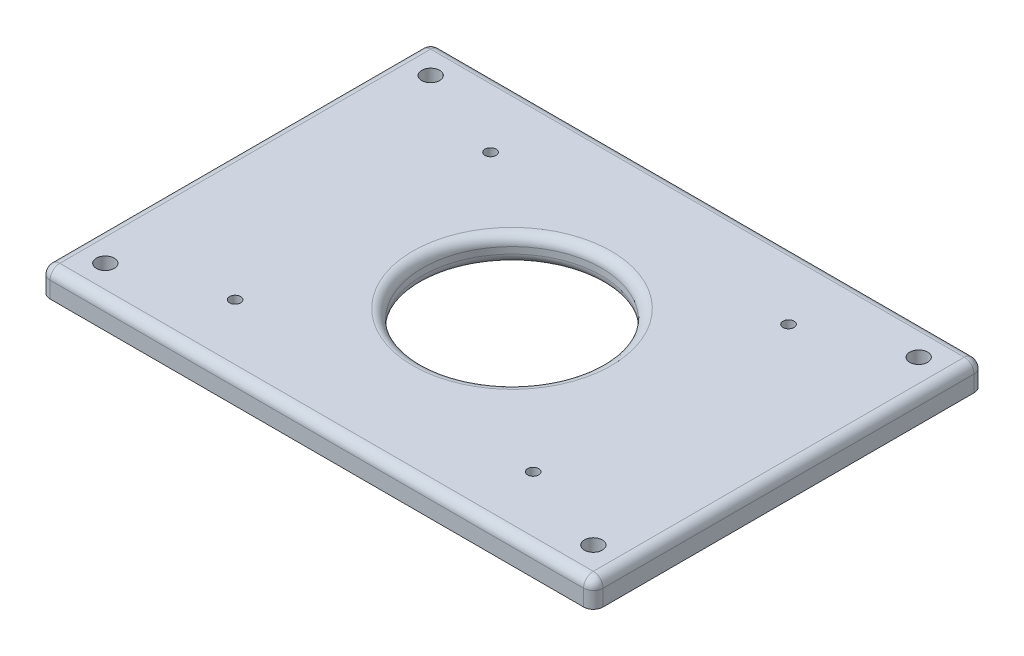
ISO-10303-21;
HEADER;
FILE_DESCRIPTION(('STEP AP214'),'2;1');
FILE_NAME('part.step','',(''),(''),'','','');
FILE_SCHEMA(('AUTOMOTIVE_DESIGN { 1 0 10303 214 1 1 1 1 }'));
ENDSEC;
DATA;
#1=APPLICATION_CONTEXT('core data for automotive mechanical design processes');
#2=APPLICATION_PROTOCOL_DEFINITION('international standard','automotive_design',2000,#1);
#3=PRODUCT_CONTEXT('',#1,'mechanical');
#4=PRODUCT('Part','Part','',(#3));
#5=PRODUCT_RELATED_PRODUCT_CATEGORY('part','',(#4));
#6=PRODUCT_DEFINITION_FORMATION('','',#4);
#7=PRODUCT_DEFINITION_CONTEXT('part definition',#1,'design');
#8=PRODUCT_DEFINITION('design','',#6,#7);
#9=PRODUCT_DEFINITION_SHAPE('','',#8);
#10=(LENGTH_UNIT() NAMED_UNIT(*) SI_UNIT(.MILLI.,.METRE.));
#11=(NAMED_UNIT(*) PLANE_ANGLE_UNIT() SI_UNIT($,.RADIAN.));
#12=(NAMED_UNIT(*) SI_UNIT($,.STERADIAN.) SOLID_ANGLE_UNIT());
#13=UNCERTAINTY_MEASURE_WITH_UNIT(LENGTH_MEASURE(1.E-05),#10,'distance_accuracy_value','');
#14=(GEOMETRIC_REPRESENTATION_CONTEXT(3) GLOBAL_UNCERTAINTY_ASSIGNED_CONTEXT((#13)) GLOBAL_UNIT_ASSIGNED_CONTEXT((#10,
#11,#12)) REPRESENTATION_CONTEXT('',''));
#15=CARTESIAN_POINT('',(0.,0.,0.));
#16=DIRECTION('',(0.,0.,1.));
#17=DIRECTION('',(1.,0.,0.));
#18=AXIS2_PLACEMENT_3D('',#15,#16,#17);
#19=CARTESIAN_POINT('',(82.,-3.,-28.));
#20=DIRECTION('',(0.,0.,-1.));
#21=DIRECTION('',(-1.,0.,0.));
#22=AXIS2_PLACEMENT_3D('',#19,#20,#21);
#23=SPHERICAL_SURFACE('',#22,3.);
#24=CARTESIAN_POINT('',(82.,-3.,-28.));
#25=DIRECTION('',(0.,-1.,0.));
#26=DIRECTION('',(0.,0.,-1.));
#27=AXIS2_PLACEMENT_3D('',#24,#25,#26);
#28=CIRCLE('',#27,3.);
#29=CARTESIAN_POINT('',(85.,-3.,-28.));
#30=VERTEX_POINT('',#29);
#31=CARTESIAN_POINT('',(82.,-3.,-25.));
#32=VERTEX_POINT('',#31);
#33=EDGE_CURVE('E11',#30,#32,#28,.T.);
#34=ORIENTED_EDGE('',*,*,#33,.F.);
#35=CARTESIAN_POINT('',(82.,-3.,-28.));
#36=DIRECTION('',(0.,0.,-1.));
#37=DIRECTION('',(-1.,0.,0.));
#38=AXIS2_PLACEMENT_3D('',#35,#36,#37);
#39=CIRCLE('',#38,3.);
#40=CARTESIAN_POINT('',(82.,0.,-28.));
#41=VERTEX_POINT('',#40);
#42=EDGE_CURVE('E147',#41,#30,#39,.T.);
#43=ORIENTED_EDGE('',*,*,#42,.F.);
#44=CARTESIAN_POINT('',(82.,-3.,-28.));
#45=DIRECTION('',(1.,0.,0.));
#46=DIRECTION('',(0.,0.,-1.));
#47=AXIS2_PLACEMENT_3D('',#44,#45,#46);
#48=CIRCLE('',#47,3.);
#49=EDGE_CURVE('E44',#41,#32,#48,.T.);
#50=ORIENTED_EDGE('',*,*,#49,.T.);
#51=EDGE_LOOP('',(#34,#43,#50));
#52=FACE_BOUND('',#51,.T.);
#53=ADVANCED_FACE('F36',(#52),#23,.T.);
#54=CARTESIAN_POINT('',(-85.,-3.,-28.));
#55=DIRECTION('',(-1.,0.,0.));
#56=DIRECTION('',(0.,0.,1.));
#57=AXIS2_PLACEMENT_3D('',#54,#55,#56);
#58=CYLINDRICAL_SURFACE('',#57,3.);
#59=ORIENTED_EDGE('',*,*,#49,.F.);
#60=DIRECTION('',(1.,0.,0.));
#61=VECTOR('',#60,1.);
#62=CARTESIAN_POINT('',(-85.,0.,-28.));
#63=LINE('',#62,#61);
#64=CARTESIAN_POINT('',(-82.,0.,-28.));
#65=VERTEX_POINT('',#64);
#66=EDGE_CURVE('E206',#65,#41,#63,.T.);
#67=ORIENTED_EDGE('',*,*,#66,.F.);
#68=CARTESIAN_POINT('',(-82.,-3.,-28.));
#69=DIRECTION('',(1.,0.,0.));
#70=DIRECTION('',(0.,0.,-1.));
#71=AXIS2_PLACEMENT_3D('',#68,#69,#70);
#72=CIRCLE('',#71,3.);
#73=CARTESIAN_POINT('',(-82.,-3.,-25.));
#74=VERTEX_POINT('',#73);
#75=EDGE_CURVE('E215',#65,#74,#72,.T.);
#76=ORIENTED_EDGE('',*,*,#75,.T.);
#77=DIRECTION('',(1.,0.,0.));
#78=VECTOR('',#77,1.);
#79=CARTESIAN_POINT('',(-85.,-3.,-25.));
#80=LINE('',#79,#78);
#81=EDGE_CURVE('E193',#32,#74,#80,.F.);
#82=ORIENTED_EDGE('',*,*,#81,.F.);
#83=EDGE_LOOP('',(#59,#67,#76,#82));
#84=FACE_BOUND('',#83,.T.);
#85=ADVANCED_FACE('F216',(#84),#58,.T.);
#86=CARTESIAN_POINT('',(-82.,-3.,-28.));
#87=DIRECTION('',(0.,0.,-1.));
#88=DIRECTION('',(-1.,0.,0.));
#89=AXIS2_PLACEMENT_3D('',#86,#87,#88);
#90=SPHERICAL_SURFACE('',#89,3.);
#91=ORIENTED_EDGE('',*,*,#75,.F.);
#92=CARTESIAN_POINT('',(-82.,-3.,-28.));
#93=DIRECTION('',(0.,0.,1.));
#94=DIRECTION('',(1.,0.,0.));
#95=AXIS2_PLACEMENT_3D('',#92,#93,#94);
#96=CIRCLE('',#95,3.);
#97=CARTESIAN_POINT('',(-85.,-3.,-28.));
#98=VERTEX_POINT('',#97);
#99=EDGE_CURVE('E203',#98,#65,#96,.F.);
#100=ORIENTED_EDGE('',*,*,#99,.F.);
#101=CARTESIAN_POINT('',(-82.,-3.,-28.));
#102=DIRECTION('',(0.,1.,0.));
#103=DIRECTION('',(0.,0.,1.));
#104=AXIS2_PLACEMENT_3D('',#101,#102,#103);
#105=CIRCLE('',#104,3.);
#106=EDGE_CURVE('E212',#98,#74,#105,.T.);
#107=ORIENTED_EDGE('',*,*,#106,.T.);
#108=EDGE_LOOP('',(#91,#100,#107));
#109=FACE_BOUND('',#108,.T.);
#110=ADVANCED_FACE('F311',(#109),#90,.T.);
#111=CARTESIAN_POINT('',(-82.,-8.00000000000002,-28.));
#112=DIRECTION('',(0.,-1.,0.));
#113=DIRECTION('',(0.,0.,-1.));
#114=AXIS2_PLACEMENT_3D('',#111,#112,#113);
#115=CYLINDRICAL_SURFACE('',#114,3.);
#116=ORIENTED_EDGE('',*,*,#106,.F.);
#117=DIRECTION('',(0.,1.,0.));
#118=VECTOR('',#117,1.);
#119=CARTESIAN_POINT('',(-85.,-8.00000000000002,-28.));
#120=LINE('',#119,#118);
#121=CARTESIAN_POINT('',(-85.,-8.00000000000002,-28.));
#122=VERTEX_POINT('',#121);
#123=EDGE_CURVE('E187',#122,#98,#120,.T.);
#124=ORIENTED_EDGE('',*,*,#123,.F.);
#125=CARTESIAN_POINT('',(-82.,-8.00000000000002,-28.));
#126=DIRECTION('',(0.,-1.,0.));
#127=DIRECTION('',(1.,0.,0.));
#128=AXIS2_PLACEMENT_3D('',#125,#126,#127);
#129=CIRCLE('',#128,3.);
#130=CARTESIAN_POINT('',(-82.,-8.00000000000002,-25.));
#131=VERTEX_POINT('',#130);
#132=EDGE_CURVE('E201',#131,#122,#129,.T.);
#133=ORIENTED_EDGE('',*,*,#132,.F.);
#134=DIRECTION('',(0.,1.,0.));
#135=VECTOR('',#134,1.);
#136=CARTESIAN_POINT('',(-82.,-8.00000000000002,-25.));
#137=LINE('',#136,#135);
#138=EDGE_CURVE('E196',#74,#131,#137,.F.);
#139=ORIENTED_EDGE('',*,*,#138,.F.);
#140=EDGE_LOOP('',(#116,#124,#133,#139));
#141=FACE_BOUND('',#140,.T.);
#142=ADVANCED_FACE('F316',(#141),#115,.T.);
#143=CARTESIAN_POINT('',(82.,0.,-28.));
#144=DIRECTION('',(0.,1.,0.));
#145=DIRECTION('',(0.,0.,1.));
#146=AXIS2_PLACEMENT_3D('',#143,#144,#145);
#147=CYLINDRICAL_SURFACE('',#146,3.);
#148=DIRECTION('',(0.,-1.,0.));
#149=VECTOR('',#148,1.);
#150=CARTESIAN_POINT('',(85.,0.,-28.));
#151=LINE('',#150,#149);
#152=CARTESIAN_POINT('',(85.,-8.,-28.));
#153=VERTEX_POINT('',#152);
#154=EDGE_CURVE('E210',#30,#153,#151,.T.);
#155=ORIENTED_EDGE('',*,*,#154,.F.);
#156=ORIENTED_EDGE('',*,*,#33,.T.);
#157=DIRECTION('',(0.,-1.,0.));
#158=VECTOR('',#157,1.);
#159=CARTESIAN_POINT('',(82.,0.,-25.));
#160=LINE('',#159,#158);
#161=CARTESIAN_POINT('',(82.,-8.00000000000002,-25.));
#162=VERTEX_POINT('',#161);
#163=EDGE_CURVE('E190',#162,#32,#160,.F.);
#164=ORIENTED_EDGE('',*,*,#163,.F.);
#165=CARTESIAN_POINT('',(82.,-8.,-28.));
#166=DIRECTION('',(0.,-1.,0.));
#167=DIRECTION('',(1.,0.,0.));
#168=AXIS2_PLACEMENT_3D('',#165,#166,#167);
#169=CIRCLE('',#168,3.);
#170=EDGE_CURVE('E199',#153,#162,#169,.T.);
#171=ORIENTED_EDGE('',*,*,#170,.F.);
#172=EDGE_LOOP('',(#155,#156,#164,#171));
#173=FACE_BOUND('',#172,.T.);
#174=ADVANCED_FACE('F38',(#173),#147,.T.);
#175=CARTESIAN_POINT('',(-82.,-3.,-142.));
#176=DIRECTION('',(0.,0.,1.));
#177=DIRECTION('',(1.,0.,0.));
#178=AXIS2_PLACEMENT_3D('',#175,#176,#177);
#179=SPHERICAL_SURFACE('',#178,3.);
#180=CARTESIAN_POINT('',(-82.,-3.,-142.));
#181=DIRECTION('',(0.,-1.,0.));
#182=DIRECTION('',(0.,0.,-1.));
#183=AXIS2_PLACEMENT_3D('',#180,#181,#182);
#184=CIRCLE('',#183,3.);
#185=CARTESIAN_POINT('',(-85.,-3.,-142.));
#186=VERTEX_POINT('',#185);
#187=CARTESIAN_POINT('',(-82.,-3.,-145.));
#188=VERTEX_POINT('',#187);
#189=EDGE_CURVE('E185',#186,#188,#184,.T.);
#190=ORIENTED_EDGE('',*,*,#189,.F.);
#191=CARTESIAN_POINT('',(-82.,-3.,-142.));
#192=DIRECTION('',(0.,0.,1.));
#193=DIRECTION('',(1.,0.,0.));
#194=AXIS2_PLACEMENT_3D('',#191,#192,#193);
#195=CIRCLE('',#194,3.);
#196=CARTESIAN_POINT('',(-82.,0.,-142.));
#197=VERTEX_POINT('',#196);
#198=EDGE_CURVE('E177',#197,#186,#195,.T.);
#199=ORIENTED_EDGE('',*,*,#198,.F.);
#200=CARTESIAN_POINT('',(-82.,-3.,-142.));
#201=DIRECTION('',(-1.,0.,0.));
#202=DIRECTION('',(0.,0.,1.));
#203=AXIS2_PLACEMENT_3D('',#200,#201,#202);
#204=CIRCLE('',#203,3.);
#205=EDGE_CURVE('E182',#197,#188,#204,.T.);
#206=ORIENTED_EDGE('',*,*,#205,.T.);
#207=EDGE_LOOP('',(#190,#199,#206));
#208=FACE_BOUND('',#207,.T.);
#209=ADVANCED_FACE('F326',(#208),#179,.T.);
#210=CARTESIAN_POINT('',(-85.,-3.,-142.));
#211=DIRECTION('',(1.,0.,0.));
#212=DIRECTION('',(0.,0.,-1.));
#213=AXIS2_PLACEMENT_3D('',#210,#211,#212);
#214=CYLINDRICAL_SURFACE('',#213,3.);
#215=ORIENTED_EDGE('',*,*,#205,.F.);
#216=DIRECTION('',(-1.,0.,0.));
#217=VECTOR('',#216,1.);
#218=CARTESIAN_POINT('',(-85.,0.,-142.));
#219=LINE('',#218,#217);
#220=CARTESIAN_POINT('',(82.,0.,-142.));
#221=VERTEX_POINT('',#220);
#222=EDGE_CURVE('E133',#221,#197,#219,.T.);
#223=ORIENTED_EDGE('',*,*,#222,.F.);
#224=CARTESIAN_POINT('',(82.,-3.,-142.));
#225=DIRECTION('',(-1.,0.,0.));
#226=DIRECTION('',(0.,0.,1.));
#227=AXIS2_PLACEMENT_3D('',#224,#225,#226);
#228=CIRCLE('',#227,3.);
#229=CARTESIAN_POINT('',(82.,-3.,-145.));
#230=VERTEX_POINT('',#229);
#231=EDGE_CURVE('E123',#221,#230,#228,.T.);
#232=ORIENTED_EDGE('',*,*,#231,.T.);
#233=DIRECTION('',(-1.,0.,0.));
#234=VECTOR('',#233,1.);
#235=CARTESIAN_POINT('',(-85.,-3.,-145.));
#236=LINE('',#235,#234);
#237=EDGE_CURVE('E169',#188,#230,#236,.F.);
#238=ORIENTED_EDGE('',*,*,#237,.F.);
#239=EDGE_LOOP('',(#215,#223,#232,#238));
#240=FACE_BOUND('',#239,.T.);
#241=ADVANCED_FACE('F329',(#240),#214,.T.);
#242=CARTESIAN_POINT('',(82.,-3.,-142.));
#243=DIRECTION('',(0.,0.,1.));
#244=DIRECTION('',(1.,0.,0.));
#245=AXIS2_PLACEMENT_3D('',#242,#243,#244);
#246=SPHERICAL_SURFACE('',#245,3.);
#247=ORIENTED_EDGE('',*,*,#231,.F.);
#248=CARTESIAN_POINT('',(82.,-3.,-142.));
#249=DIRECTION('',(0.,0.,-1.));
#250=DIRECTION('',(-1.,0.,0.));
#251=AXIS2_PLACEMENT_3D('',#248,#249,#250);
#252=CIRCLE('',#251,3.);
#253=CARTESIAN_POINT('',(85.,-3.,-142.));
#254=VERTEX_POINT('',#253);
#255=EDGE_CURVE('E127',#254,#221,#252,.F.);
#256=ORIENTED_EDGE('',*,*,#255,.F.);
#257=CARTESIAN_POINT('',(82.,-3.,-142.));
#258=DIRECTION('',(0.,1.,0.));
#259=DIRECTION('',(0.,0.,1.));
#260=AXIS2_PLACEMENT_3D('',#257,#258,#259);
#261=CIRCLE('',#260,3.);
#262=EDGE_CURVE('E112',#254,#230,#261,.T.);
#263=ORIENTED_EDGE('',*,*,#262,.T.);
#264=EDGE_LOOP('',(#247,#256,#263));
#265=FACE_BOUND('',#264,.T.);
#266=ADVANCED_FACE('F128',(#265),#246,.T.);
#267=CARTESIAN_POINT('',(82.,0.,-142.));
#268=DIRECTION('',(0.,-1.,0.));
#269=DIRECTION('',(0.,0.,-1.));
#270=AXIS2_PLACEMENT_3D('',#267,#268,#269);
#271=CYLINDRICAL_SURFACE('',#270,3.);
#272=ORIENTED_EDGE('',*,*,#262,.F.);
#273=DIRECTION('',(0.,1.,0.));
#274=VECTOR('',#273,1.);
#275=CARTESIAN_POINT('',(85.,0.,-142.));
#276=LINE('',#275,#274);
#277=CARTESIAN_POINT('',(85.,-8.,-142.));
#278=VERTEX_POINT('',#277);
#279=EDGE_CURVE('E116',#278,#254,#276,.T.);
#280=ORIENTED_EDGE('',*,*,#279,.F.);
#281=CARTESIAN_POINT('',(82.,-8.,-142.));
#282=DIRECTION('',(0.,-1.,0.));
#283=DIRECTION('',(1.,0.,0.));
#284=AXIS2_PLACEMENT_3D('',#281,#282,#283);
#285=CIRCLE('',#284,3.);
#286=CARTESIAN_POINT('',(82.,-8.00000000000002,-145.));
#287=VERTEX_POINT('',#286);
#288=EDGE_CURVE('E134',#287,#278,#285,.T.);
#289=ORIENTED_EDGE('',*,*,#288,.F.);
#290=DIRECTION('',(0.,1.,0.));
#291=VECTOR('',#290,1.);
#292=CARTESIAN_POINT('',(82.,0.,-145.));
#293=LINE('',#292,#291);
#294=EDGE_CURVE('E119',#230,#287,#293,.F.);
#295=ORIENTED_EDGE('',*,*,#294,.F.);
#296=EDGE_LOOP('',(#272,#280,#289,#295));
#297=FACE_BOUND('',#296,.T.);
#298=ADVANCED_FACE('F114',(#297),#271,.T.);
#299=CARTESIAN_POINT('',(-82.,-8.00000000000002,-142.));
#300=DIRECTION('',(0.,1.,0.));
#301=DIRECTION('',(0.,0.,1.));
#302=AXIS2_PLACEMENT_3D('',#299,#300,#301);
#303=CYLINDRICAL_SURFACE('',#302,3.);
#304=DIRECTION('',(0.,-1.,0.));
#305=VECTOR('',#304,1.);
#306=CARTESIAN_POINT('',(-85.,-8.00000000000002,-142.));
#307=LINE('',#306,#305);
#308=CARTESIAN_POINT('',(-85.,-8.00000000000002,-142.));
#309=VERTEX_POINT('',#308);
#310=EDGE_CURVE('E124',#186,#309,#307,.T.);
#311=ORIENTED_EDGE('',*,*,#310,.F.);
#312=ORIENTED_EDGE('',*,*,#189,.T.);
#313=DIRECTION('',(0.,-1.,0.));
#314=VECTOR('',#313,1.);
#315=CARTESIAN_POINT('',(-82.,-8.00000000000002,-145.));
#316=LINE('',#315,#314);
#317=CARTESIAN_POINT('',(-82.,-8.00000000000002,-145.));
#318=VERTEX_POINT('',#317);
#319=EDGE_CURVE('E142',#318,#188,#316,.F.);
#320=ORIENTED_EDGE('',*,*,#319,.F.);
#321=CARTESIAN_POINT('',(-82.,-8.00000000000002,-142.));
#322=DIRECTION('',(0.,-1.,0.));
#323=DIRECTION('',(1.,0.,0.));
#324=AXIS2_PLACEMENT_3D('',#321,#322,#323);
#325=CIRCLE('',#324,3.);
#326=EDGE_CURVE('E172',#309,#318,#325,.T.);
#327=ORIENTED_EDGE('',*,*,#326,.F.);
#328=EDGE_LOOP('',(#311,#312,#320,#327));
#329=FACE_BOUND('',#328,.T.);
#330=ADVANCED_FACE('F321',(#329),#303,.T.);
#331=CARTESIAN_POINT('',(-0.5,-5.00000000000001,-85.5));
#332=DIRECTION('',(0.,-1.,0.));
#333=DIRECTION('',(1.,0.,0.));
#334=AXIS2_PLACEMENT_3D('',#331,#332,#333);
#335=TOROIDAL_SURFACE('',#334,30.5,3.);
#336=CARTESIAN_POINT('',(-0.5,-8.00000000000001,-85.5));
#337=DIRECTION('',(0.,-1.,0.));
#338=DIRECTION('',(1.,0.,0.));
#339=AXIS2_PLACEMENT_3D('',#336,#337,#338);
#340=CIRCLE('',#339,30.5);
#341=CARTESIAN_POINT('',(30.,-8.00000000000001,-85.5));
#342=VERTEX_POINT('',#341);
#343=EDGE_CURVE('E162',#342,#342,#340,.F.);
#344=ORIENTED_EDGE('',*,*,#343,.F.);
#345=EDGE_LOOP('',(#344));
#346=FACE_BOUND('',#345,.T.);
#347=CARTESIAN_POINT('',(-0.5,-5.00000000000001,-85.5));
#348=DIRECTION('',(0.,-1.,0.));
#349=DIRECTION('',(1.,0.,0.));
#350=AXIS2_PLACEMENT_3D('',#347,#348,#349);
#351=CIRCLE('',#350,27.5);
#352=CARTESIAN_POINT('',(27.,-5.00000000000001,-85.5));
#353=VERTEX_POINT('',#352);
#354=EDGE_CURVE('E143',#353,#353,#351,.T.);
#355=ORIENTED_EDGE('',*,*,#354,.F.);
#356=EDGE_LOOP('',(#355));
#357=FACE_BOUND('',#356,.T.);
#358=ADVANCED_FACE('F324',(#346,#357),#335,.T.);
#359=CARTESIAN_POINT('',(-0.5,-3.,-85.5));
#360=DIRECTION('',(0.,1.,0.));
#361=DIRECTION('',(0.,0.,1.));
#362=AXIS2_PLACEMENT_3D('',#359,#360,#361);
#363=TOROIDAL_SURFACE('',#362,30.5,3.);
#364=CARTESIAN_POINT('',(-0.5,0.,-85.5));
#365=DIRECTION('',(0.,1.,0.));
#366=DIRECTION('',(0.,0.,1.));
#367=AXIS2_PLACEMENT_3D('',#364,#365,#366);
#368=CIRCLE('',#367,30.5);
#369=CARTESIAN_POINT('',(-0.5,0.,-55.));
#370=VERTEX_POINT('',#369);
#371=EDGE_CURVE('E151',#370,#370,#368,.F.);
#372=ORIENTED_EDGE('',*,*,#371,.F.);
#373=EDGE_LOOP('',(#372));
#374=FACE_BOUND('',#373,.T.);
#375=CARTESIAN_POINT('',(-0.5,-3.,-85.5));
#376=DIRECTION('',(0.,1.,0.));
#377=DIRECTION('',(0.,0.,1.));
#378=AXIS2_PLACEMENT_3D('',#375,#376,#377);
#379=CIRCLE('',#378,27.5);
#380=CARTESIAN_POINT('',(-0.5,-3.,-58.));
#381=VERTEX_POINT('',#380);
#382=EDGE_CURVE('E159',#381,#381,#379,.T.);
#383=ORIENTED_EDGE('',*,*,#382,.F.);
#384=EDGE_LOOP('',(#383));
#385=FACE_BOUND('',#384,.T.);
#386=ADVANCED_FACE('F340',(#374,#385),#363,.T.);
#387=CARTESIAN_POINT('',(-82.,-3.,-170.));
#388=DIRECTION('',(0.,0.,1.));
#389=DIRECTION('',(1.,0.,0.));
#390=AXIS2_PLACEMENT_3D('',#387,#388,#389);
#391=CYLINDRICAL_SURFACE('',#390,3.);
#392=DIRECTION('',(0.,0.,1.));
#393=VECTOR('',#392,1.);
#394=CARTESIAN_POINT('',(-85.,-3.,-170.));
#395=LINE('',#394,#393);
#396=EDGE_CURVE('E148',#98,#186,#395,.F.);
#397=ORIENTED_EDGE('',*,*,#396,.F.);
#398=ORIENTED_EDGE('',*,*,#99,.T.);
#399=DIRECTION('',(0.,0.,1.));
#400=VECTOR('',#399,1.);
#401=CARTESIAN_POINT('',(-82.,0.,-170.));
#402=LINE('',#401,#400);
#403=EDGE_CURVE('E153',#197,#65,#402,.T.);
#404=ORIENTED_EDGE('',*,*,#403,.F.);
#405=ORIENTED_EDGE('',*,*,#198,.T.);
#406=EDGE_LOOP('',(#397,#398,#404,#405));
#407=FACE_BOUND('',#406,.T.);
#408=ADVANCED_FACE('F344',(#407),#391,.T.);
#409=CARTESIAN_POINT('',(82.,-3.,-170.));
#410=DIRECTION('',(0.,0.,-1.));
#411=DIRECTION('',(-1.,0.,0.));
#412=AXIS2_PLACEMENT_3D('',#409,#410,#411);
#413=CYLINDRICAL_SURFACE('',#412,3.);
#414=DIRECTION('',(0.,0.,-1.));
#415=VECTOR('',#414,1.);
#416=CARTESIAN_POINT('',(82.,0.,-170.));
#417=LINE('',#416,#415);
#418=EDGE_CURVE('E149',#41,#221,#417,.T.);
#419=ORIENTED_EDGE('',*,*,#418,.F.);
#420=ORIENTED_EDGE('',*,*,#42,.T.);
#421=DIRECTION('',(0.,0.,-1.));
#422=VECTOR('',#421,1.);
#423=CARTESIAN_POINT('',(85.,-3.,-170.));
#424=LINE('',#423,#422);
#425=EDGE_CURVE('E139',#254,#30,#424,.F.);
#426=ORIENTED_EDGE('',*,*,#425,.F.);
#427=ORIENTED_EDGE('',*,*,#255,.T.);
#428=EDGE_LOOP('',(#419,#420,#426,#427));
#429=FACE_BOUND('',#428,.T.);
#430=ADVANCED_FACE('F146',(#429),#413,.T.);
#431=CARTESIAN_POINT('',(-45.35,-8.00000000000002,-45.25));
#432=DIRECTION('',(0.,1.,0.));
#433=DIRECTION('',(0.,0.,1.));
#434=AXIS2_PLACEMENT_3D('',#431,#432,#433);
#435=CYLINDRICAL_SURFACE('',#434,1.7);
#436=CARTESIAN_POINT('',(-45.35,0.,-45.25));
#437=DIRECTION('',(0.,1.,0.));
#438=DIRECTION('',(0.,0.,1.));
#439=AXIS2_PLACEMENT_3D('',#436,#437,#438);
#440=CIRCLE('',#439,1.7);
#441=CARTESIAN_POINT('',(-45.35,0.,-43.55));
#442=VERTEX_POINT('',#441);
#443=EDGE_CURVE('E264',#442,#442,#440,.T.);
#444=ORIENTED_EDGE('',*,*,#443,.T.);
#445=EDGE_LOOP('',(#444));
#446=FACE_BOUND('',#445,.T.);
#447=CARTESIAN_POINT('',(-45.35,-4.50000000000002,-45.25));
#448=DIRECTION('',(0.,-1.,0.));
#449=DIRECTION('',(1.,0.,0.));
#450=AXIS2_PLACEMENT_3D('',#447,#448,#449);
#451=CIRCLE('',#450,1.7);
#452=CARTESIAN_POINT('',(-43.65,-4.50000000000002,-45.25));
#453=VERTEX_POINT('',#452);
#454=EDGE_CURVE('E249',#453,#453,#451,.F.);
#455=ORIENTED_EDGE('',*,*,#454,.F.);
#456=EDGE_LOOP('',(#455));
#457=FACE_BOUND('',#456,.T.);
#458=ADVANCED_FACE('F350',(#446,#457),#435,.F.);
#459=CARTESIAN_POINT('',(46.25,-8.00000000000002,-45.25));
#460=DIRECTION('',(0.,1.,0.));
#461=DIRECTION('',(0.,0.,1.));
#462=AXIS2_PLACEMENT_3D('',#459,#460,#461);
#463=CYLINDRICAL_SURFACE('',#462,1.7);
#464=CARTESIAN_POINT('',(46.25,0.,-45.25));
#465=DIRECTION('',(0.,1.,0.));
#466=DIRECTION('',(0.,0.,1.));
#467=AXIS2_PLACEMENT_3D('',#464,#465,#466);
#468=CIRCLE('',#467,1.7);
#469=CARTESIAN_POINT('',(46.25,0.,-43.55));
#470=VERTEX_POINT('',#469);
#471=EDGE_CURVE('E260',#470,#470,#468,.T.);
#472=ORIENTED_EDGE('',*,*,#471,.T.);
#473=EDGE_LOOP('',(#472));
#474=FACE_BOUND('',#473,.T.);
#475=CARTESIAN_POINT('',(46.25,-4.50000000000001,-45.25));
#476=DIRECTION('',(0.,-1.,0.));
#477=DIRECTION('',(1.,0.,0.));
#478=AXIS2_PLACEMENT_3D('',#475,#476,#477);
#479=CIRCLE('',#478,1.7);
#480=CARTESIAN_POINT('',(47.95,-4.50000000000001,-45.25));
#481=VERTEX_POINT('',#480);
#482=EDGE_CURVE('E246',#481,#481,#479,.F.);
#483=ORIENTED_EDGE('',*,*,#482,.F.);
#484=EDGE_LOOP('',(#483));
#485=FACE_BOUND('',#484,.T.);
#486=ADVANCED_FACE('F375',(#474,#485),#463,.F.);
#487=CARTESIAN_POINT('',(46.25,-8.00000000000002,-123.75));
#488=DIRECTION('',(0.,1.,0.));
#489=DIRECTION('',(0.,0.,1.));
#490=AXIS2_PLACEMENT_3D('',#487,#488,#489);
#491=CYLINDRICAL_SURFACE('',#490,1.7);
#492=CARTESIAN_POINT('',(46.25,0.,-123.75));
#493=DIRECTION('',(0.,1.,0.));
#494=DIRECTION('',(0.,0.,1.));
#495=AXIS2_PLACEMENT_3D('',#492,#493,#494);
#496=CIRCLE('',#495,1.7);
#497=CARTESIAN_POINT('',(46.25,0.,-122.05));
#498=VERTEX_POINT('',#497);
#499=EDGE_CURVE('E255',#498,#498,#496,.T.);
#500=ORIENTED_EDGE('',*,*,#499,.T.);
#501=EDGE_LOOP('',(#500));
#502=FACE_BOUND('',#501,.T.);
#503=CARTESIAN_POINT('',(46.25,-4.50000000000001,-123.75));
#504=DIRECTION('',(0.,-1.,0.));
#505=DIRECTION('',(1.,0.,0.));
#506=AXIS2_PLACEMENT_3D('',#503,#504,#505);
#507=CIRCLE('',#506,1.7);
#508=CARTESIAN_POINT('',(47.95,-4.50000000000001,-123.75));
#509=VERTEX_POINT('',#508);
#510=EDGE_CURVE('E242',#509,#509,#507,.F.);
#511=ORIENTED_EDGE('',*,*,#510,.F.);
#512=EDGE_LOOP('',(#511));
#513=FACE_BOUND('',#512,.T.);
#514=ADVANCED_FACE('F379',(#502,#513),#491,.F.);
#515=CARTESIAN_POINT('',(-45.35,-8.00000000000002,-123.75));
#516=DIRECTION('',(0.,1.,0.));
#517=DIRECTION('',(0.,0.,1.));
#518=AXIS2_PLACEMENT_3D('',#515,#516,#517);
#519=CYLINDRICAL_SURFACE('',#518,1.7);
#520=CARTESIAN_POINT('',(-45.35,0.,-123.75));
#521=DIRECTION('',(0.,1.,0.));
#522=DIRECTION('',(0.,0.,1.));
#523=AXIS2_PLACEMENT_3D('',#520,#521,#522);
#524=CIRCLE('',#523,1.7);
#525=CARTESIAN_POINT('',(-45.35,0.,-122.05));
#526=VERTEX_POINT('',#525);
#527=EDGE_CURVE('E251',#526,#526,#524,.T.);
#528=ORIENTED_EDGE('',*,*,#527,.T.);
#529=EDGE_LOOP('',(#528));
#530=FACE_BOUND('',#529,.T.);
#531=CARTESIAN_POINT('',(-45.35,-4.50000000000002,-123.75));
#532=DIRECTION('',(0.,-1.,0.));
#533=DIRECTION('',(1.,0.,0.));
#534=AXIS2_PLACEMENT_3D('',#531,#532,#533);
#535=CIRCLE('',#534,1.7);
#536=CARTESIAN_POINT('',(-43.65,-4.50000000000002,-123.75));
#537=VERTEX_POINT('',#536);
#538=EDGE_CURVE('E239',#537,#537,#535,.F.);
#539=ORIENTED_EDGE('',*,*,#538,.F.);
#540=EDGE_LOOP('',(#539));
#541=FACE_BOUND('',#540,.T.);
#542=ADVANCED_FACE('F302',(#530,#541),#519,.F.);
#543=CARTESIAN_POINT('',(-85.,-8.00000000000002,-170.));
#544=DIRECTION('',(-1.,0.,0.));
#545=DIRECTION('',(0.,0.,1.));
#546=AXIS2_PLACEMENT_3D('',#543,#544,#545);
#547=PLANE('',#546);
#548=DIRECTION('',(0.,0.,1.));
#549=VECTOR('',#548,1.);
#550=CARTESIAN_POINT('',(-85.,-8.00000000000002,-170.));
#551=LINE('',#550,#549);
#552=EDGE_CURVE('E229',#309,#122,#551,.T.);
#553=ORIENTED_EDGE('',*,*,#552,.T.);
#554=ORIENTED_EDGE('',*,*,#123,.T.);
#555=ORIENTED_EDGE('',*,*,#396,.T.);
#556=ORIENTED_EDGE('',*,*,#310,.T.);
#557=EDGE_LOOP('',(#553,#554,#555,#556));
#558=FACE_BOUND('',#557,.T.);
#559=ADVANCED_FACE('F294',(#558),#547,.T.);
#560=CARTESIAN_POINT('',(-85.,0.,-170.));
#561=DIRECTION('',(0.,1.,0.));
#562=DIRECTION('',(0.,0.,1.));
#563=AXIS2_PLACEMENT_3D('',#560,#561,#562);
#564=PLANE('',#563);
#565=ORIENTED_EDGE('',*,*,#403,.T.);
#566=ORIENTED_EDGE('',*,*,#66,.T.);
#567=ORIENTED_EDGE('',*,*,#418,.T.);
#568=ORIENTED_EDGE('',*,*,#222,.T.);
#569=EDGE_LOOP('',(#565,#566,#567,#568));
#570=FACE_BOUND('',#569,.T.);
#571=ORIENTED_EDGE('',*,*,#371,.T.);
#572=EDGE_LOOP('',(#571));
#573=FACE_BOUND('',#572,.T.);
#574=ORIENTED_EDGE('',*,*,#527,.F.);
#575=EDGE_LOOP('',(#574));
#576=FACE_BOUND('',#575,.T.);
#577=ORIENTED_EDGE('',*,*,#499,.F.);
#578=EDGE_LOOP('',(#577));
#579=FACE_BOUND('',#578,.T.);
#580=ORIENTED_EDGE('',*,*,#471,.F.);
#581=EDGE_LOOP('',(#580));
#582=FACE_BOUND('',#581,.T.);
#583=ORIENTED_EDGE('',*,*,#443,.F.);
#584=EDGE_LOOP('',(#583));
#585=FACE_BOUND('',#584,.T.);
#586=CARTESIAN_POINT('',(-75.,0.,-135.));
#587=DIRECTION('',(0.,1.,0.));
#588=DIRECTION('',(0.,0.,1.));
#589=AXIS2_PLACEMENT_3D('',#586,#587,#588);
#590=CIRCLE('',#589,2.75000000000001);
#591=CARTESIAN_POINT('',(-75.,0.,-132.25));
#592=VERTEX_POINT('',#591);
#593=EDGE_CURVE('E267',#592,#592,#590,.T.);
#594=ORIENTED_EDGE('',*,*,#593,.F.);
#595=EDGE_LOOP('',(#594));
#596=FACE_BOUND('',#595,.T.);
#597=CARTESIAN_POINT('',(75.,0.,-135.));
#598=DIRECTION('',(0.,1.,0.));
#599=DIRECTION('',(0.,0.,1.));
#600=AXIS2_PLACEMENT_3D('',#597,#598,#599);
#601=CIRCLE('',#600,2.75000000000001);
#602=CARTESIAN_POINT('',(75.,0.,-132.25));
#603=VERTEX_POINT('',#602);
#604=EDGE_CURVE('E277',#603,#603,#601,.T.);
#605=ORIENTED_EDGE('',*,*,#604,.F.);
#606=EDGE_LOOP('',(#605));
#607=FACE_BOUND('',#606,.T.);
#608=CARTESIAN_POINT('',(75.,0.,-35.));
#609=DIRECTION('',(0.,1.,0.));
#610=DIRECTION('',(0.,0.,1.));
#611=AXIS2_PLACEMENT_3D('',#608,#609,#610);
#612=CIRCLE('',#611,2.75000000000001);
#613=CARTESIAN_POINT('',(75.,0.,-32.25));
#614=VERTEX_POINT('',#613);
#615=EDGE_CURVE('E271',#614,#614,#612,.T.);
#616=ORIENTED_EDGE('',*,*,#615,.F.);
#617=EDGE_LOOP('',(#616));
#618=FACE_BOUND('',#617,.T.);
#619=CARTESIAN_POINT('',(-75.,0.,-35.));
#620=DIRECTION('',(0.,1.,0.));
#621=DIRECTION('',(0.,0.,1.));
#622=AXIS2_PLACEMENT_3D('',#619,#620,#621);
#623=CIRCLE('',#622,2.75000000000001);
#624=CARTESIAN_POINT('',(-75.,0.,-32.25));
#625=VERTEX_POINT('',#624);
#626=EDGE_CURVE('E236',#625,#625,#623,.T.);
#627=ORIENTED_EDGE('',*,*,#626,.F.);
#628=EDGE_LOOP('',(#627));
#629=FACE_BOUND('',#628,.T.);
#630=ADVANCED_FACE('F292',(#570,#573,#576,#579,#582,#585,#596,#607,#618,#629),#564,.T.);
#631=CARTESIAN_POINT('',(85.,0.,-170.));
#632=DIRECTION('',(1.,0.,0.));
#633=DIRECTION('',(0.,0.,-1.));
#634=AXIS2_PLACEMENT_3D('',#631,#632,#633);
#635=PLANE('',#634);
#636=ORIENTED_EDGE('',*,*,#425,.T.);
#637=ORIENTED_EDGE('',*,*,#154,.T.);
#638=DIRECTION('',(0.,0.,1.));
#639=VECTOR('',#638,1.);
#640=CARTESIAN_POINT('',(85.,-8.,-170.));
#641=LINE('',#640,#639);
#642=EDGE_CURVE('E141',#278,#153,#641,.T.);
#643=ORIENTED_EDGE('',*,*,#642,.F.);
#644=ORIENTED_EDGE('',*,*,#279,.T.);
#645=EDGE_LOOP('',(#636,#637,#643,#644));
#646=FACE_BOUND('',#645,.T.);
#647=ADVANCED_FACE('F138',(#646),#635,.T.);
#648=CARTESIAN_POINT('',(85.,-8.,-170.));
#649=DIRECTION('',(0.,-1.,0.));
#650=DIRECTION('',(1.,0.,0.));
#651=AXIS2_PLACEMENT_3D('',#648,#649,#650);
#652=PLANE('',#651);
#653=DIRECTION('',(-1.,0.,0.));
#654=VECTOR('',#653,1.);
#655=CARTESIAN_POINT('',(85.,-8.00000000000002,-25.));
#656=LINE('',#655,#654);
#657=EDGE_CURVE('E222',#162,#131,#656,.T.);
#658=ORIENTED_EDGE('',*,*,#657,.T.);
#659=ORIENTED_EDGE('',*,*,#132,.T.);
#660=ORIENTED_EDGE('',*,*,#552,.F.);
#661=ORIENTED_EDGE('',*,*,#326,.T.);
#662=DIRECTION('',(1.,0.,0.));
#663=VECTOR('',#662,1.);
#664=CARTESIAN_POINT('',(85.,-8.00000000000002,-145.));
#665=LINE('',#664,#663);
#666=EDGE_CURVE('E439',#318,#287,#665,.T.);
#667=ORIENTED_EDGE('',*,*,#666,.T.);
#668=ORIENTED_EDGE('',*,*,#288,.T.);
#669=ORIENTED_EDGE('',*,*,#642,.T.);
#670=ORIENTED_EDGE('',*,*,#170,.T.);
#671=EDGE_LOOP('',(#658,#659,#660,#661,#667,#668,#669,#670));
#672=FACE_BOUND('',#671,.T.);
#673=ORIENTED_EDGE('',*,*,#343,.T.);
#674=EDGE_LOOP('',(#673));
#675=FACE_BOUND('',#674,.T.);
#676=CARTESIAN_POINT('',(-45.35,-8.00000000000002,-123.75));
#677=DIRECTION('',(0.,-1.,0.));
#678=DIRECTION('',(1.,0.,0.));
#679=AXIS2_PLACEMENT_3D('',#676,#677,#678);
#680=CIRCLE('',#679,3.375);
#681=CARTESIAN_POINT('',(-41.975,-8.00000000000002,-123.75));
#682=VERTEX_POINT('',#681);
#683=EDGE_CURVE('E441',#682,#682,#680,.T.);
#684=ORIENTED_EDGE('',*,*,#683,.F.);
#685=EDGE_LOOP('',(#684));
#686=FACE_BOUND('',#685,.T.);
#687=CARTESIAN_POINT('',(46.25,-8.00000000000001,-123.75));
#688=DIRECTION('',(0.,-1.,0.));
#689=DIRECTION('',(1.,0.,0.));
#690=AXIS2_PLACEMENT_3D('',#687,#688,#689);
#691=CIRCLE('',#690,3.375);
#692=CARTESIAN_POINT('',(49.625,-8.00000000000001,-123.75));
#693=VERTEX_POINT('',#692);
#694=EDGE_CURVE('E454',#693,#693,#691,.T.);
#695=ORIENTED_EDGE('',*,*,#694,.F.);
#696=EDGE_LOOP('',(#695));
#697=FACE_BOUND('',#696,.T.);
#698=CARTESIAN_POINT('',(46.25,-8.00000000000001,-45.25));
#699=DIRECTION('',(0.,-1.,0.));
#700=DIRECTION('',(1.,0.,0.));
#701=AXIS2_PLACEMENT_3D('',#698,#699,#700);
#702=CIRCLE('',#701,3.375);
#703=CARTESIAN_POINT('',(49.625,-8.00000000000001,-45.25));
#704=VERTEX_POINT('',#703);
#705=EDGE_CURVE('E448',#704,#704,#702,.T.);
#706=ORIENTED_EDGE('',*,*,#705,.F.);
#707=EDGE_LOOP('',(#706));
#708=FACE_BOUND('',#707,.T.);
#709=CARTESIAN_POINT('',(-45.35,-8.00000000000002,-45.25));
#710=DIRECTION('',(0.,-1.,0.));
#711=DIRECTION('',(1.,0.,0.));
#712=AXIS2_PLACEMENT_3D('',#709,#710,#711);
#713=CIRCLE('',#712,3.375);
#714=CARTESIAN_POINT('',(-41.975,-8.00000000000002,-45.25));
#715=VERTEX_POINT('',#714);
#716=EDGE_CURVE('E447',#715,#715,#713,.T.);
#717=ORIENTED_EDGE('',*,*,#716,.F.);
#718=EDGE_LOOP('',(#717));
#719=FACE_BOUND('',#718,.T.);
#720=CARTESIAN_POINT('',(-75.,-8.00000000000002,-135.));
#721=DIRECTION('',(0.,1.,0.));
#722=DIRECTION('',(0.,0.,1.));
#723=AXIS2_PLACEMENT_3D('',#720,#721,#722);
#724=CIRCLE('',#723,2.75000000000001);
#725=CARTESIAN_POINT('',(-75.,-8.00000000000002,-132.25));
#726=VERTEX_POINT('',#725);
#727=EDGE_CURVE('E280',#726,#726,#724,.T.);
#728=ORIENTED_EDGE('',*,*,#727,.T.);
#729=EDGE_LOOP('',(#728));
#730=FACE_BOUND('',#729,.T.);
#731=CARTESIAN_POINT('',(75.,-8.00000000000002,-135.));
#732=DIRECTION('',(0.,1.,0.));
#733=DIRECTION('',(0.,0.,1.));
#734=AXIS2_PLACEMENT_3D('',#731,#732,#733);
#735=CIRCLE('',#734,2.75000000000001);
#736=CARTESIAN_POINT('',(75.,-8.00000000000002,-132.25));
#737=VERTEX_POINT('',#736);
#738=EDGE_CURVE('E274',#737,#737,#735,.T.);
#739=ORIENTED_EDGE('',*,*,#738,.T.);
#740=EDGE_LOOP('',(#739));
#741=FACE_BOUND('',#740,.T.);
#742=CARTESIAN_POINT('',(75.,-8.00000000000002,-35.));
#743=DIRECTION('',(0.,1.,0.));
#744=DIRECTION('',(0.,0.,1.));
#745=AXIS2_PLACEMENT_3D('',#742,#743,#744);
#746=CIRCLE('',#745,2.75000000000001);
#747=CARTESIAN_POINT('',(75.,-8.00000000000002,-32.25));
#748=VERTEX_POINT('',#747);
#749=EDGE_CURVE('E268',#748,#748,#746,.T.);
#750=ORIENTED_EDGE('',*,*,#749,.T.);
#751=EDGE_LOOP('',(#750));
#752=FACE_BOUND('',#751,.T.);
#753=CARTESIAN_POINT('',(-75.,-8.00000000000002,-35.));
#754=DIRECTION('',(0.,1.,0.));
#755=DIRECTION('',(0.,0.,1.));
#756=AXIS2_PLACEMENT_3D('',#753,#754,#755);
#757=CIRCLE('',#756,2.75000000000001);
#758=CARTESIAN_POINT('',(-75.,-8.00000000000002,-32.25));
#759=VERTEX_POINT('',#758);
#760=EDGE_CURVE('E233',#759,#759,#757,.T.);
#761=ORIENTED_EDGE('',*,*,#760,.T.);
#762=EDGE_LOOP('',(#761));
#763=FACE_BOUND('',#762,.T.);
#764=ADVANCED_FACE('F226',(#672,#675,#686,#697,#708,#719,#730,#741,#752,#763),#652,.T.);
#765=CARTESIAN_POINT('',(-75.,-8.00000000000002,-35.));
#766=DIRECTION('',(0.,1.,0.));
#767=DIRECTION('',(0.,0.,1.));
#768=AXIS2_PLACEMENT_3D('',#765,#766,#767);
#769=CYLINDRICAL_SURFACE('',#768,2.75000000000001);
#770=ORIENTED_EDGE('',*,*,#760,.F.);
#771=EDGE_LOOP('',(#770));
#772=FACE_BOUND('',#771,.T.);
#773=ORIENTED_EDGE('',*,*,#626,.T.);
#774=EDGE_LOOP('',(#773));
#775=FACE_BOUND('',#774,.T.);
#776=ADVANCED_FACE('F290',(#772,#775),#769,.F.);
#777=CARTESIAN_POINT('',(75.,-8.00000000000002,-35.));
#778=DIRECTION('',(0.,1.,0.));
#779=DIRECTION('',(0.,0.,1.));
#780=AXIS2_PLACEMENT_3D('',#777,#778,#779);
#781=CYLINDRICAL_SURFACE('',#780,2.75000000000001);
#782=ORIENTED_EDGE('',*,*,#749,.F.);
#783=EDGE_LOOP('',(#782));
#784=FACE_BOUND('',#783,.T.);
#785=ORIENTED_EDGE('',*,*,#615,.T.);
#786=EDGE_LOOP('',(#785));
#787=FACE_BOUND('',#786,.T.);
#788=ADVANCED_FACE('F356',(#784,#787),#781,.F.);
#789=CARTESIAN_POINT('',(75.,-8.00000000000002,-135.));
#790=DIRECTION('',(0.,1.,0.));
#791=DIRECTION('',(0.,0.,1.));
#792=AXIS2_PLACEMENT_3D('',#789,#790,#791);
#793=CYLINDRICAL_SURFACE('',#792,2.75000000000001);
#794=ORIENTED_EDGE('',*,*,#738,.F.);
#795=EDGE_LOOP('',(#794));
#796=FACE_BOUND('',#795,.T.);
#797=ORIENTED_EDGE('',*,*,#604,.T.);
#798=EDGE_LOOP('',(#797));
#799=FACE_BOUND('',#798,.T.);
#800=ADVANCED_FACE('F361',(#796,#799),#793,.F.);
#801=CARTESIAN_POINT('',(-75.,-8.00000000000002,-135.));
#802=DIRECTION('',(0.,1.,0.));
#803=DIRECTION('',(0.,0.,1.));
#804=AXIS2_PLACEMENT_3D('',#801,#802,#803);
#805=CYLINDRICAL_SURFACE('',#804,2.75000000000001);
#806=ORIENTED_EDGE('',*,*,#727,.F.);
#807=EDGE_LOOP('',(#806));
#808=FACE_BOUND('',#807,.T.);
#809=ORIENTED_EDGE('',*,*,#593,.T.);
#810=EDGE_LOOP('',(#809));
#811=FACE_BOUND('',#810,.T.);
#812=ADVANCED_FACE('F365',(#808,#811),#805,.F.);
#813=CARTESIAN_POINT('',(-45.35,-4.50000000000002,-123.75));
#814=DIRECTION('',(0.,-1.,0.));
#815=DIRECTION('',(1.,0.,0.));
#816=AXIS2_PLACEMENT_3D('',#813,#814,#815);
#817=PLANE('',#816);
#818=CARTESIAN_POINT('',(-45.35,-4.50000000000002,-123.75));
#819=DIRECTION('',(0.,-1.,0.));
#820=DIRECTION('',(1.,0.,0.));
#821=AXIS2_PLACEMENT_3D('',#818,#819,#820);
#822=CIRCLE('',#821,3.375);
#823=CARTESIAN_POINT('',(-41.975,-4.50000000000002,-123.75));
#824=VERTEX_POINT('',#823);
#825=EDGE_CURVE('E457',#824,#824,#822,.T.);
#826=ORIENTED_EDGE('',*,*,#825,.T.);
#827=EDGE_LOOP('',(#826));
#828=FACE_BOUND('',#827,.T.);
#829=ORIENTED_EDGE('',*,*,#538,.T.);
#830=EDGE_LOOP('',(#829));
#831=FACE_BOUND('',#830,.T.);
#832=ADVANCED_FACE('F368',(#828,#831),#817,.T.);
#833=CARTESIAN_POINT('',(-45.35,-4.50000000000002,-123.75));
#834=DIRECTION('',(0.,-1.,0.));
#835=DIRECTION('',(1.,0.,0.));
#836=AXIS2_PLACEMENT_3D('',#833,#834,#835);
#837=CYLINDRICAL_SURFACE('',#836,3.375);
#838=ORIENTED_EDGE('',*,*,#825,.F.);
#839=EDGE_LOOP('',(#838));
#840=FACE_BOUND('',#839,.T.);
#841=ORIENTED_EDGE('',*,*,#683,.T.);
#842=EDGE_LOOP('',(#841));
#843=FACE_BOUND('',#842,.T.);
#844=ADVANCED_FACE('F396',(#840,#843),#837,.F.);
#845=CARTESIAN_POINT('',(46.25,-4.50000000000001,-123.75));
#846=DIRECTION('',(0.,-1.,0.));
#847=DIRECTION('',(1.,0.,0.));
#848=AXIS2_PLACEMENT_3D('',#845,#846,#847);
#849=PLANE('',#848);
#850=CARTESIAN_POINT('',(46.25,-4.50000000000001,-123.75));
#851=DIRECTION('',(0.,-1.,0.));
#852=DIRECTION('',(1.,0.,0.));
#853=AXIS2_PLACEMENT_3D('',#850,#851,#852);
#854=CIRCLE('',#853,3.375);
#855=CARTESIAN_POINT('',(49.625,-4.50000000000001,-123.75));
#856=VERTEX_POINT('',#855);
#857=EDGE_CURVE('E451',#856,#856,#854,.T.);
#858=ORIENTED_EDGE('',*,*,#857,.T.);
#859=EDGE_LOOP('',(#858));
#860=FACE_BOUND('',#859,.T.);
#861=ORIENTED_EDGE('',*,*,#510,.T.);
#862=EDGE_LOOP('',(#861));
#863=FACE_BOUND('',#862,.T.);
#864=ADVANCED_FACE('F399',(#860,#863),#849,.T.);
#865=CARTESIAN_POINT('',(46.25,-4.50000000000001,-123.75));
#866=DIRECTION('',(0.,-1.,0.));
#867=DIRECTION('',(1.,0.,0.));
#868=AXIS2_PLACEMENT_3D('',#865,#866,#867);
#869=CYLINDRICAL_SURFACE('',#868,3.375);
#870=ORIENTED_EDGE('',*,*,#857,.F.);
#871=EDGE_LOOP('',(#870));
#872=FACE_BOUND('',#871,.T.);
#873=ORIENTED_EDGE('',*,*,#694,.T.);
#874=EDGE_LOOP('',(#873));
#875=FACE_BOUND('',#874,.T.);
#876=ADVANCED_FACE('F404',(#872,#875),#869,.F.);
#877=CARTESIAN_POINT('',(46.25,-4.50000000000001,-45.25));
#878=DIRECTION('',(0.,-1.,0.));
#879=DIRECTION('',(1.,0.,0.));
#880=AXIS2_PLACEMENT_3D('',#877,#878,#879);
#881=PLANE('',#880);
#882=CARTESIAN_POINT('',(46.25,-4.50000000000001,-45.25));
#883=DIRECTION('',(0.,-1.,0.));
#884=DIRECTION('',(1.,0.,0.));
#885=AXIS2_PLACEMENT_3D('',#882,#883,#884);
#886=CIRCLE('',#885,3.375);
#887=CARTESIAN_POINT('',(49.625,-4.50000000000001,-45.25));
#888=VERTEX_POINT('',#887);
#889=EDGE_CURVE('E444',#888,#888,#886,.T.);
#890=ORIENTED_EDGE('',*,*,#889,.T.);
#891=EDGE_LOOP('',(#890));
#892=FACE_BOUND('',#891,.T.);
#893=ORIENTED_EDGE('',*,*,#482,.T.);
#894=EDGE_LOOP('',(#893));
#895=FACE_BOUND('',#894,.T.);
#896=ADVANCED_FACE('F407',(#892,#895),#881,.T.);
#897=CARTESIAN_POINT('',(46.25,-4.50000000000001,-45.25));
#898=DIRECTION('',(0.,-1.,0.));
#899=DIRECTION('',(1.,0.,0.));
#900=AXIS2_PLACEMENT_3D('',#897,#898,#899);
#901=CYLINDRICAL_SURFACE('',#900,3.375);
#902=ORIENTED_EDGE('',*,*,#889,.F.);
#903=EDGE_LOOP('',(#902));
#904=FACE_BOUND('',#903,.T.);
#905=ORIENTED_EDGE('',*,*,#705,.T.);
#906=EDGE_LOOP('',(#905));
#907=FACE_BOUND('',#906,.T.);
#908=ADVANCED_FACE('F394',(#904,#907),#901,.F.);
#909=CARTESIAN_POINT('',(-45.35,-4.50000000000002,-45.25));
#910=DIRECTION('',(0.,-1.,0.));
#911=DIRECTION('',(1.,0.,0.));
#912=AXIS2_PLACEMENT_3D('',#909,#910,#911);
#913=PLANE('',#912);
#914=CARTESIAN_POINT('',(-45.35,-4.50000000000002,-45.25));
#915=DIRECTION('',(0.,-1.,0.));
#916=DIRECTION('',(1.,0.,0.));
#917=AXIS2_PLACEMENT_3D('',#914,#915,#916);
#918=CIRCLE('',#917,3.375);
#919=CARTESIAN_POINT('',(-41.975,-4.50000000000002,-45.25));
#920=VERTEX_POINT('',#919);
#921=EDGE_CURVE('E243',#920,#920,#918,.T.);
#922=ORIENTED_EDGE('',*,*,#921,.T.);
#923=EDGE_LOOP('',(#922));
#924=FACE_BOUND('',#923,.T.);
#925=ORIENTED_EDGE('',*,*,#454,.T.);
#926=EDGE_LOOP('',(#925));
#927=FACE_BOUND('',#926,.T.);
#928=ADVANCED_FACE('F390',(#924,#927),#913,.T.);
#929=CARTESIAN_POINT('',(-45.35,-4.50000000000002,-45.25));
#930=DIRECTION('',(0.,-1.,0.));
#931=DIRECTION('',(1.,0.,0.));
#932=AXIS2_PLACEMENT_3D('',#929,#930,#931);
#933=CYLINDRICAL_SURFACE('',#932,3.375);
#934=ORIENTED_EDGE('',*,*,#921,.F.);
#935=EDGE_LOOP('',(#934));
#936=FACE_BOUND('',#935,.T.);
#937=ORIENTED_EDGE('',*,*,#716,.T.);
#938=EDGE_LOOP('',(#937));
#939=FACE_BOUND('',#938,.T.);
#940=ADVANCED_FACE('F386',(#936,#939),#933,.F.);
#941=CARTESIAN_POINT('',(-0.5,-8.00000000000002,-85.5));
#942=DIRECTION('',(0.,1.,0.));
#943=DIRECTION('',(0.,0.,1.));
#944=AXIS2_PLACEMENT_3D('',#941,#942,#943);
#945=CYLINDRICAL_SURFACE('',#944,27.5);
#946=ORIENTED_EDGE('',*,*,#354,.T.);
#947=EDGE_LOOP('',(#946));
#948=FACE_BOUND('',#947,.T.);
#949=ORIENTED_EDGE('',*,*,#382,.T.);
#950=EDGE_LOOP('',(#949));
#951=FACE_BOUND('',#950,.T.);
#952=ADVANCED_FACE('F389',(#948,#951),#945,.F.);
#953=CARTESIAN_POINT('',(85.,-8.00000000000002,-25.));
#954=DIRECTION('',(0.,0.,-1.));
#955=DIRECTION('',(-1.,0.,0.));
#956=AXIS2_PLACEMENT_3D('',#953,#954,#955);
#957=PLANE('',#956);
#958=ORIENTED_EDGE('',*,*,#81,.T.);
#959=ORIENTED_EDGE('',*,*,#138,.T.);
#960=ORIENTED_EDGE('',*,*,#657,.F.);
#961=ORIENTED_EDGE('',*,*,#163,.T.);
#962=EDGE_LOOP('',(#958,#959,#960,#961));
#963=FACE_BOUND('',#962,.T.);
#964=ADVANCED_FACE('F220',(#963),#957,.F.);
#965=CARTESIAN_POINT('',(85.,-8.00000000000002,-145.));
#966=DIRECTION('',(0.,0.,1.));
#967=DIRECTION('',(1.,0.,0.));
#968=AXIS2_PLACEMENT_3D('',#965,#966,#967);
#969=PLANE('',#968);
#970=ORIENTED_EDGE('',*,*,#237,.T.);
#971=ORIENTED_EDGE('',*,*,#294,.T.);
#972=ORIENTED_EDGE('',*,*,#666,.F.);
#973=ORIENTED_EDGE('',*,*,#319,.T.);
#974=EDGE_LOOP('',(#970,#971,#972,#973));
#975=FACE_BOUND('',#974,.T.);
#976=ADVANCED_FACE('F423',(#975),#969,.F.);
#977=CLOSED_SHELL('',(#53,#85,#110,#142,#174,#209,#241,#266,#298,#330,#358,#386,#408,#430,#458,
#486,#514,#542,#559,#630,#647,#764,#776,#788,#800,#812,#832,#844,#864,#876,#896,#908,#928,#940,
#952,#964,#976));
#978=MANIFOLD_SOLID_BREP('B2',#977);
#979=ADVANCED_BREP_SHAPE_REPRESENTATION('',(#18,#978),#14);
#980=SHAPE_DEFINITION_REPRESENTATION(#9,#979);
ENDSEC;
END-ISO-10303-21;
